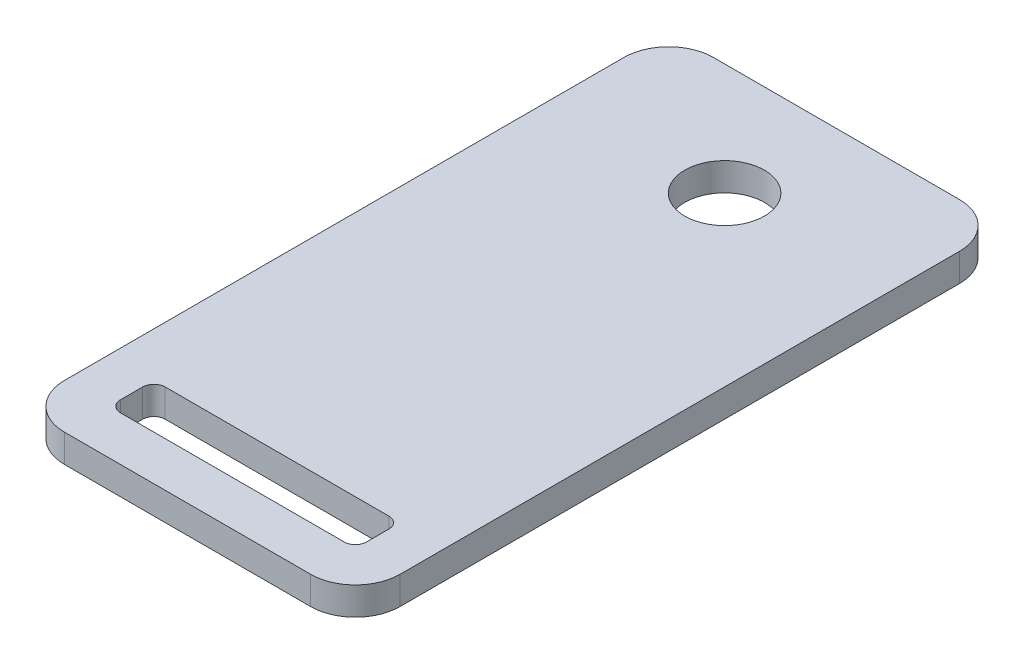
ISO-10303-21;
HEADER;
FILE_DESCRIPTION(('STEP AP214'),'2;1');
FILE_NAME('part.step','',(''),(''),'','','');
FILE_SCHEMA(('AUTOMOTIVE_DESIGN { 1 0 10303 214 1 1 1 1 }'));
ENDSEC;
DATA;
#1=APPLICATION_CONTEXT('core data for automotive mechanical design processes');
#2=APPLICATION_PROTOCOL_DEFINITION('international standard','automotive_design',2000,#1);
#3=PRODUCT_CONTEXT('',#1,'mechanical');
#4=PRODUCT('Part','Part','',(#3));
#5=PRODUCT_RELATED_PRODUCT_CATEGORY('part','',(#4));
#6=PRODUCT_DEFINITION_FORMATION('','',#4);
#7=PRODUCT_DEFINITION_CONTEXT('part definition',#1,'design');
#8=PRODUCT_DEFINITION('design','',#6,#7);
#9=PRODUCT_DEFINITION_SHAPE('','',#8);
#10=(LENGTH_UNIT() NAMED_UNIT(*) SI_UNIT(.MILLI.,.METRE.));
#11=(NAMED_UNIT(*) PLANE_ANGLE_UNIT() SI_UNIT($,.RADIAN.));
#12=(NAMED_UNIT(*) SI_UNIT($,.STERADIAN.) SOLID_ANGLE_UNIT());
#13=UNCERTAINTY_MEASURE_WITH_UNIT(LENGTH_MEASURE(1.E-05),#10,'distance_accuracy_value','');
#14=(GEOMETRIC_REPRESENTATION_CONTEXT(3) GLOBAL_UNCERTAINTY_ASSIGNED_CONTEXT((#13)) GLOBAL_UNIT_ASSIGNED_CONTEXT((#10,
#11,#12)) REPRESENTATION_CONTEXT('',''));
#15=CARTESIAN_POINT('',(0.,0.,0.));
#16=DIRECTION('',(0.,0.,1.));
#17=DIRECTION('',(1.,0.,0.));
#18=AXIS2_PLACEMENT_3D('',#15,#16,#17);
#19=CARTESIAN_POINT('',(0.,3.175,0.));
#20=DIRECTION('',(0.,1.,0.));
#21=DIRECTION('',(0.,0.,1.));
#22=AXIS2_PLACEMENT_3D('',#19,#20,#21);
#23=PLANE('',#22);
#24=DIRECTION('',(-1.,0.,0.));
#25=VECTOR('',#24,1.);
#26=CARTESIAN_POINT('',(-19.05,3.175,-12.7));
#27=LINE('',#26,#25);
#28=CARTESIAN_POINT('',(13.97,3.175,-12.7));
#29=VERTEX_POINT('',#28);
#30=CARTESIAN_POINT('',(-13.97,3.175,-12.7));
#31=VERTEX_POINT('',#30);
#32=EDGE_CURVE('E182',#29,#31,#27,.T.);
#33=ORIENTED_EDGE('',*,*,#32,.T.);
#34=CARTESIAN_POINT('',(-13.97,3.175,-7.62));
#35=DIRECTION('',(0.,1.,0.));
#36=DIRECTION('',(0.,0.,1.));
#37=AXIS2_PLACEMENT_3D('',#34,#35,#36);
#38=CIRCLE('',#37,5.08);
#39=CARTESIAN_POINT('',(-19.05,3.175,-7.62));
#40=VERTEX_POINT('',#39);
#41=EDGE_CURVE('E203',#31,#40,#38,.T.);
#42=ORIENTED_EDGE('',*,*,#41,.T.);
#43=DIRECTION('',(0.,0.,1.));
#44=VECTOR('',#43,1.);
#45=CARTESIAN_POINT('',(-19.05,3.175,-12.7));
#46=LINE('',#45,#44);
#47=CARTESIAN_POINT('',(-19.05,3.175,55.88));
#48=VERTEX_POINT('',#47);
#49=EDGE_CURVE('E165',#40,#48,#46,.T.);
#50=ORIENTED_EDGE('',*,*,#49,.T.);
#51=CARTESIAN_POINT('',(-13.97,3.175,55.88));
#52=DIRECTION('',(0.,1.,0.));
#53=DIRECTION('',(0.,0.,1.));
#54=AXIS2_PLACEMENT_3D('',#51,#52,#53);
#55=CIRCLE('',#54,5.08);
#56=CARTESIAN_POINT('',(-13.97,3.175,60.96));
#57=VERTEX_POINT('',#56);
#58=EDGE_CURVE('E197',#48,#57,#55,.T.);
#59=ORIENTED_EDGE('',*,*,#58,.T.);
#60=DIRECTION('',(1.,0.,0.));
#61=VECTOR('',#60,1.);
#62=CARTESIAN_POINT('',(-19.05,3.175,60.96));
#63=LINE('',#62,#61);
#64=CARTESIAN_POINT('',(13.97,3.175,60.96));
#65=VERTEX_POINT('',#64);
#66=EDGE_CURVE('E279',#57,#65,#63,.T.);
#67=ORIENTED_EDGE('',*,*,#66,.T.);
#68=CARTESIAN_POINT('',(13.97,3.175,55.88));
#69=DIRECTION('',(0.,1.,0.));
#70=DIRECTION('',(0.,0.,1.));
#71=AXIS2_PLACEMENT_3D('',#68,#69,#70);
#72=CIRCLE('',#71,5.08);
#73=CARTESIAN_POINT('',(19.05,3.175,55.88));
#74=VERTEX_POINT('',#73);
#75=EDGE_CURVE('E199',#65,#74,#72,.T.);
#76=ORIENTED_EDGE('',*,*,#75,.T.);
#77=DIRECTION('',(0.,0.,-1.));
#78=VECTOR('',#77,1.);
#79=CARTESIAN_POINT('',(19.05,3.175,-12.7));
#80=LINE('',#79,#78);
#81=CARTESIAN_POINT('',(19.05,3.175,-7.62));
#82=VERTEX_POINT('',#81);
#83=EDGE_CURVE('E281',#74,#82,#80,.T.);
#84=ORIENTED_EDGE('',*,*,#83,.T.);
#85=CARTESIAN_POINT('',(13.97,3.175,-7.62));
#86=DIRECTION('',(0.,1.,0.));
#87=DIRECTION('',(0.,0.,1.));
#88=AXIS2_PLACEMENT_3D('',#85,#86,#87);
#89=CIRCLE('',#88,5.08);
#90=EDGE_CURVE('E201',#82,#29,#89,.T.);
#91=ORIENTED_EDGE('',*,*,#90,.T.);
#92=EDGE_LOOP('',(#33,#42,#50,#59,#67,#76,#84,#91));
#93=FACE_BOUND('',#92,.T.);
#94=CARTESIAN_POINT('',(0.,3.175,0.));
#95=DIRECTION('',(0.,1.,0.));
#96=DIRECTION('',(0.,0.,1.));
#97=AXIS2_PLACEMENT_3D('',#94,#95,#96);
#98=CIRCLE('',#97,4.5212);
#99=CARTESIAN_POINT('',(0.,3.175,4.5212));
#100=VERTEX_POINT('',#99);
#101=EDGE_CURVE('E173',#100,#100,#98,.T.);
#102=ORIENTED_EDGE('',*,*,#101,.F.);
#103=EDGE_LOOP('',(#102));
#104=FACE_BOUND('',#103,.T.);
#105=DIRECTION('',(1.,0.,0.));
#106=VECTOR('',#105,1.);
#107=CARTESIAN_POINT('',(-13.97,3.175,55.8800000000001));
#108=LINE('',#107,#106);
#109=CARTESIAN_POINT('',(-12.7,3.175,55.8800000000001));
#110=VERTEX_POINT('',#109);
#111=CARTESIAN_POINT('',(12.7,3.175,55.88));
#112=VERTEX_POINT('',#111);
#113=EDGE_CURVE('E267',#110,#112,#108,.T.);
#114=ORIENTED_EDGE('',*,*,#113,.F.);
#115=CARTESIAN_POINT('',(-12.7,3.175,54.6100000000001));
#116=DIRECTION('',(0.,1.,0.));
#117=DIRECTION('',(0.,0.,1.));
#118=AXIS2_PLACEMENT_3D('',#115,#116,#117);
#119=CIRCLE('',#118,1.27);
#120=CARTESIAN_POINT('',(-13.97,3.175,54.6100000000001));
#121=VERTEX_POINT('',#120);
#122=EDGE_CURVE('E236',#110,#121,#119,.F.);
#123=ORIENTED_EDGE('',*,*,#122,.T.);
#124=DIRECTION('',(0.,0.,1.));
#125=VECTOR('',#124,1.);
#126=CARTESIAN_POINT('',(-13.97,3.175,50.8));
#127=LINE('',#126,#125);
#128=CARTESIAN_POINT('',(-13.97,3.175,52.07));
#129=VERTEX_POINT('',#128);
#130=EDGE_CURVE('E276',#129,#121,#127,.T.);
#131=ORIENTED_EDGE('',*,*,#130,.F.);
#132=CARTESIAN_POINT('',(-12.7,3.175,52.07));
#133=DIRECTION('',(0.,1.,0.));
#134=DIRECTION('',(0.,0.,1.));
#135=AXIS2_PLACEMENT_3D('',#132,#133,#134);
#136=CIRCLE('',#135,1.27);
#137=CARTESIAN_POINT('',(-12.7,3.175,50.8));
#138=VERTEX_POINT('',#137);
#139=EDGE_CURVE('E11',#129,#138,#136,.F.);
#140=ORIENTED_EDGE('',*,*,#139,.T.);
#141=DIRECTION('',(-1.,0.,0.));
#142=VECTOR('',#141,1.);
#143=CARTESIAN_POINT('',(-13.97,3.175,50.8));
#144=LINE('',#143,#142);
#145=CARTESIAN_POINT('',(12.7,3.175,50.8));
#146=VERTEX_POINT('',#145);
#147=EDGE_CURVE('E260',#146,#138,#144,.T.);
#148=ORIENTED_EDGE('',*,*,#147,.F.);
#149=CARTESIAN_POINT('',(12.7,3.175,52.07));
#150=DIRECTION('',(0.,1.,0.));
#151=DIRECTION('',(0.,0.,1.));
#152=AXIS2_PLACEMENT_3D('',#149,#150,#151);
#153=CIRCLE('',#152,1.27);
#154=CARTESIAN_POINT('',(13.97,3.175,52.07));
#155=VERTEX_POINT('',#154);
#156=EDGE_CURVE('E244',#146,#155,#153,.F.);
#157=ORIENTED_EDGE('',*,*,#156,.T.);
#158=DIRECTION('',(0.,0.,-1.));
#159=VECTOR('',#158,1.);
#160=CARTESIAN_POINT('',(13.97,3.175,50.8));
#161=LINE('',#160,#159);
#162=CARTESIAN_POINT('',(13.97,3.175,54.61));
#163=VERTEX_POINT('',#162);
#164=EDGE_CURVE('E262',#163,#155,#161,.T.);
#165=ORIENTED_EDGE('',*,*,#164,.F.);
#166=CARTESIAN_POINT('',(12.7,3.175,54.61));
#167=DIRECTION('',(0.,1.,0.));
#168=DIRECTION('',(0.,0.,1.));
#169=AXIS2_PLACEMENT_3D('',#166,#167,#168);
#170=CIRCLE('',#169,1.27);
#171=EDGE_CURVE('E240',#163,#112,#170,.F.);
#172=ORIENTED_EDGE('',*,*,#171,.T.);
#173=EDGE_LOOP('',(#114,#123,#131,#140,#148,#157,#165,#172));
#174=FACE_BOUND('',#173,.T.);
#175=ADVANCED_FACE('F32',(#93,#104,#174),#23,.T.);
#176=CARTESIAN_POINT('',(0.,0.,0.));
#177=DIRECTION('',(0.,1.,0.));
#178=DIRECTION('',(0.,0.,1.));
#179=AXIS2_PLACEMENT_3D('',#176,#177,#178);
#180=PLANE('',#179);
#181=CARTESIAN_POINT('',(0.,0.,0.));
#182=DIRECTION('',(0.,1.,0.));
#183=DIRECTION('',(0.,0.,1.));
#184=AXIS2_PLACEMENT_3D('',#181,#182,#183);
#185=CIRCLE('',#184,4.5212);
#186=CARTESIAN_POINT('',(0.,0.,4.5212));
#187=VERTEX_POINT('',#186);
#188=EDGE_CURVE('E179',#187,#187,#185,.T.);
#189=ORIENTED_EDGE('',*,*,#188,.T.);
#190=EDGE_LOOP('',(#189));
#191=FACE_BOUND('',#190,.T.);
#192=DIRECTION('',(0.,0.,1.));
#193=VECTOR('',#192,1.);
#194=CARTESIAN_POINT('',(-19.05,0.,-12.7));
#195=LINE('',#194,#193);
#196=CARTESIAN_POINT('',(-19.05,0.,-7.62));
#197=VERTEX_POINT('',#196);
#198=CARTESIAN_POINT('',(-19.05,0.,55.88));
#199=VERTEX_POINT('',#198);
#200=EDGE_CURVE('E162',#197,#199,#195,.T.);
#201=ORIENTED_EDGE('',*,*,#200,.F.);
#202=CARTESIAN_POINT('',(-13.97,0.,-7.62));
#203=DIRECTION('',(0.,1.,0.));
#204=DIRECTION('',(0.,0.,1.));
#205=AXIS2_PLACEMENT_3D('',#202,#203,#204);
#206=CIRCLE('',#205,5.08);
#207=CARTESIAN_POINT('',(-13.97,0.,-12.7));
#208=VERTEX_POINT('',#207);
#209=EDGE_CURVE('E145',#197,#208,#206,.F.);
#210=ORIENTED_EDGE('',*,*,#209,.T.);
#211=DIRECTION('',(-1.,0.,0.));
#212=VECTOR('',#211,1.);
#213=CARTESIAN_POINT('',(-19.05,0.,-12.7));
#214=LINE('',#213,#212);
#215=CARTESIAN_POINT('',(13.97,0.,-12.7));
#216=VERTEX_POINT('',#215);
#217=EDGE_CURVE('E187',#216,#208,#214,.T.);
#218=ORIENTED_EDGE('',*,*,#217,.F.);
#219=CARTESIAN_POINT('',(13.97,0.,-7.62));
#220=DIRECTION('',(0.,1.,0.));
#221=DIRECTION('',(0.,0.,1.));
#222=AXIS2_PLACEMENT_3D('',#219,#220,#221);
#223=CIRCLE('',#222,5.08);
#224=CARTESIAN_POINT('',(19.05,0.,-7.62));
#225=VERTEX_POINT('',#224);
#226=EDGE_CURVE('E156',#216,#225,#223,.F.);
#227=ORIENTED_EDGE('',*,*,#226,.T.);
#228=DIRECTION('',(0.,0.,-1.));
#229=VECTOR('',#228,1.);
#230=CARTESIAN_POINT('',(19.05,0.,-12.7));
#231=LINE('',#230,#229);
#232=CARTESIAN_POINT('',(19.05,0.,55.88));
#233=VERTEX_POINT('',#232);
#234=EDGE_CURVE('E176',#233,#225,#231,.T.);
#235=ORIENTED_EDGE('',*,*,#234,.F.);
#236=CARTESIAN_POINT('',(13.97,0.,55.88));
#237=DIRECTION('',(0.,1.,0.));
#238=DIRECTION('',(0.,0.,1.));
#239=AXIS2_PLACEMENT_3D('',#236,#237,#238);
#240=CIRCLE('',#239,5.08);
#241=CARTESIAN_POINT('',(13.97,0.,60.96));
#242=VERTEX_POINT('',#241);
#243=EDGE_CURVE('E191',#233,#242,#240,.F.);
#244=ORIENTED_EDGE('',*,*,#243,.T.);
#245=DIRECTION('',(1.,0.,0.));
#246=VECTOR('',#245,1.);
#247=CARTESIAN_POINT('',(-19.05,0.,60.96));
#248=LINE('',#247,#246);
#249=CARTESIAN_POINT('',(-13.97,0.,60.96));
#250=VERTEX_POINT('',#249);
#251=EDGE_CURVE('E172',#250,#242,#248,.T.);
#252=ORIENTED_EDGE('',*,*,#251,.F.);
#253=CARTESIAN_POINT('',(-13.97,0.,55.88));
#254=DIRECTION('',(0.,1.,0.));
#255=DIRECTION('',(0.,0.,1.));
#256=AXIS2_PLACEMENT_3D('',#253,#254,#255);
#257=CIRCLE('',#256,5.08);
#258=EDGE_CURVE('E166',#250,#199,#257,.F.);
#259=ORIENTED_EDGE('',*,*,#258,.T.);
#260=EDGE_LOOP('',(#201,#210,#218,#227,#235,#244,#252,#259));
#261=FACE_BOUND('',#260,.T.);
#262=DIRECTION('',(-1.,0.,0.));
#263=VECTOR('',#262,1.);
#264=CARTESIAN_POINT('',(-13.97,0.,50.8));
#265=LINE('',#264,#263);
#266=CARTESIAN_POINT('',(12.7,0.,50.8));
#267=VERTEX_POINT('',#266);
#268=CARTESIAN_POINT('',(-12.7,0.,50.8));
#269=VERTEX_POINT('',#268);
#270=EDGE_CURVE('E249',#267,#269,#265,.T.);
#271=ORIENTED_EDGE('',*,*,#270,.T.);
#272=CARTESIAN_POINT('',(-12.7,0.,52.07));
#273=DIRECTION('',(0.,1.,0.));
#274=DIRECTION('',(0.,0.,1.));
#275=AXIS2_PLACEMENT_3D('',#272,#273,#274);
#276=CIRCLE('',#275,1.27);
#277=CARTESIAN_POINT('',(-13.97,0.,52.07));
#278=VERTEX_POINT('',#277);
#279=EDGE_CURVE('E40',#269,#278,#276,.T.);
#280=ORIENTED_EDGE('',*,*,#279,.T.);
#281=DIRECTION('',(0.,0.,1.));
#282=VECTOR('',#281,1.);
#283=CARTESIAN_POINT('',(-13.97,0.,50.8));
#284=LINE('',#283,#282);
#285=CARTESIAN_POINT('',(-13.97,0.,54.6100000000001));
#286=VERTEX_POINT('',#285);
#287=EDGE_CURVE('E248',#278,#286,#284,.T.);
#288=ORIENTED_EDGE('',*,*,#287,.T.);
#289=CARTESIAN_POINT('',(-12.7,0.,54.6100000000001));
#290=DIRECTION('',(0.,1.,0.));
#291=DIRECTION('',(0.,0.,1.));
#292=AXIS2_PLACEMENT_3D('',#289,#290,#291);
#293=CIRCLE('',#292,1.27);
#294=CARTESIAN_POINT('',(-12.7,0.,55.8800000000001));
#295=VERTEX_POINT('',#294);
#296=EDGE_CURVE('E234',#286,#295,#293,.T.);
#297=ORIENTED_EDGE('',*,*,#296,.T.);
#298=DIRECTION('',(1.,0.,0.));
#299=VECTOR('',#298,1.);
#300=CARTESIAN_POINT('',(-13.97,0.,55.8800000000001));
#301=LINE('',#300,#299);
#302=CARTESIAN_POINT('',(12.7,0.,55.88));
#303=VERTEX_POINT('',#302);
#304=EDGE_CURVE('E257',#295,#303,#301,.T.);
#305=ORIENTED_EDGE('',*,*,#304,.T.);
#306=CARTESIAN_POINT('',(12.7,0.,54.61));
#307=DIRECTION('',(0.,1.,0.));
#308=DIRECTION('',(0.,0.,1.));
#309=AXIS2_PLACEMENT_3D('',#306,#307,#308);
#310=CIRCLE('',#309,1.27);
#311=CARTESIAN_POINT('',(13.97,0.,54.61));
#312=VERTEX_POINT('',#311);
#313=EDGE_CURVE('E238',#303,#312,#310,.T.);
#314=ORIENTED_EDGE('',*,*,#313,.T.);
#315=DIRECTION('',(0.,0.,-1.));
#316=VECTOR('',#315,1.);
#317=CARTESIAN_POINT('',(13.97,0.,50.8));
#318=LINE('',#317,#316);
#319=CARTESIAN_POINT('',(13.97,0.,52.07));
#320=VERTEX_POINT('',#319);
#321=EDGE_CURVE('E273',#312,#320,#318,.T.);
#322=ORIENTED_EDGE('',*,*,#321,.T.);
#323=CARTESIAN_POINT('',(12.7,0.,52.07));
#324=DIRECTION('',(0.,1.,0.));
#325=DIRECTION('',(0.,0.,1.));
#326=AXIS2_PLACEMENT_3D('',#323,#324,#325);
#327=CIRCLE('',#326,1.27);
#328=EDGE_CURVE('E242',#320,#267,#327,.T.);
#329=ORIENTED_EDGE('',*,*,#328,.T.);
#330=EDGE_LOOP('',(#271,#280,#288,#297,#305,#314,#322,#329));
#331=FACE_BOUND('',#330,.T.);
#332=ADVANCED_FACE('F169',(#191,#261,#331),#180,.F.);
#333=CARTESIAN_POINT('',(-19.05,3.175,-12.7));
#334=DIRECTION('',(1.,0.,0.));
#335=DIRECTION('',(0.,0.,-1.));
#336=AXIS2_PLACEMENT_3D('',#333,#334,#335);
#337=PLANE('',#336);
#338=ORIENTED_EDGE('',*,*,#49,.F.);
#339=DIRECTION('',(0.,-1.,0.));
#340=VECTOR('',#339,1.);
#341=CARTESIAN_POINT('',(-19.05,3.175,-7.62));
#342=LINE('',#341,#340);
#343=EDGE_CURVE('E149',#40,#197,#342,.T.);
#344=ORIENTED_EDGE('',*,*,#343,.T.);
#345=ORIENTED_EDGE('',*,*,#200,.T.);
#346=DIRECTION('',(0.,-1.,0.));
#347=VECTOR('',#346,1.);
#348=CARTESIAN_POINT('',(-19.05,3.175,55.88));
#349=LINE('',#348,#347);
#350=EDGE_CURVE('E167',#199,#48,#349,.F.);
#351=ORIENTED_EDGE('',*,*,#350,.T.);
#352=EDGE_LOOP('',(#338,#344,#345,#351));
#353=FACE_BOUND('',#352,.T.);
#354=ADVANCED_FACE('F161',(#353),#337,.F.);
#355=CARTESIAN_POINT('',(-19.05,3.175,60.96));
#356=DIRECTION('',(0.,0.,-1.));
#357=DIRECTION('',(-1.,0.,0.));
#358=AXIS2_PLACEMENT_3D('',#355,#356,#357);
#359=PLANE('',#358);
#360=ORIENTED_EDGE('',*,*,#251,.T.);
#361=DIRECTION('',(0.,-1.,0.));
#362=VECTOR('',#361,1.);
#363=CARTESIAN_POINT('',(13.97,3.175,60.96));
#364=LINE('',#363,#362);
#365=EDGE_CURVE('E213',#242,#65,#364,.F.);
#366=ORIENTED_EDGE('',*,*,#365,.T.);
#367=ORIENTED_EDGE('',*,*,#66,.F.);
#368=DIRECTION('',(0.,-1.,0.));
#369=VECTOR('',#368,1.);
#370=CARTESIAN_POINT('',(-13.97,3.175,60.96));
#371=LINE('',#370,#369);
#372=EDGE_CURVE('E210',#57,#250,#371,.T.);
#373=ORIENTED_EDGE('',*,*,#372,.T.);
#374=EDGE_LOOP('',(#360,#366,#367,#373));
#375=FACE_BOUND('',#374,.T.);
#376=ADVANCED_FACE('F304',(#375),#359,.F.);
#377=CARTESIAN_POINT('',(19.05,3.175,-12.7));
#378=DIRECTION('',(-1.,0.,0.));
#379=DIRECTION('',(0.,0.,1.));
#380=AXIS2_PLACEMENT_3D('',#377,#378,#379);
#381=PLANE('',#380);
#382=ORIENTED_EDGE('',*,*,#234,.T.);
#383=DIRECTION('',(0.,-1.,0.));
#384=VECTOR('',#383,1.);
#385=CARTESIAN_POINT('',(19.05,3.175,-7.62));
#386=LINE('',#385,#384);
#387=EDGE_CURVE('E208',#225,#82,#386,.F.);
#388=ORIENTED_EDGE('',*,*,#387,.T.);
#389=ORIENTED_EDGE('',*,*,#83,.F.);
#390=DIRECTION('',(0.,-1.,0.));
#391=VECTOR('',#390,1.);
#392=CARTESIAN_POINT('',(19.05,3.175,55.88));
#393=LINE('',#392,#391);
#394=EDGE_CURVE('E205',#74,#233,#393,.T.);
#395=ORIENTED_EDGE('',*,*,#394,.T.);
#396=EDGE_LOOP('',(#382,#388,#389,#395));
#397=FACE_BOUND('',#396,.T.);
#398=ADVANCED_FACE('F297',(#397),#381,.F.);
#399=CARTESIAN_POINT('',(-19.05,3.175,-12.7));
#400=DIRECTION('',(0.,0.,1.));
#401=DIRECTION('',(1.,0.,0.));
#402=AXIS2_PLACEMENT_3D('',#399,#400,#401);
#403=PLANE('',#402);
#404=ORIENTED_EDGE('',*,*,#217,.T.);
#405=DIRECTION('',(0.,-1.,0.));
#406=VECTOR('',#405,1.);
#407=CARTESIAN_POINT('',(-13.97,3.175,-12.7));
#408=LINE('',#407,#406);
#409=EDGE_CURVE('E150',#208,#31,#408,.F.);
#410=ORIENTED_EDGE('',*,*,#409,.T.);
#411=ORIENTED_EDGE('',*,*,#32,.F.);
#412=DIRECTION('',(0.,-1.,0.));
#413=VECTOR('',#412,1.);
#414=CARTESIAN_POINT('',(13.97,3.175,-12.7));
#415=LINE('',#414,#413);
#416=EDGE_CURVE('E155',#29,#216,#415,.T.);
#417=ORIENTED_EDGE('',*,*,#416,.T.);
#418=EDGE_LOOP('',(#404,#410,#411,#417));
#419=FACE_BOUND('',#418,.T.);
#420=ADVANCED_FACE('F291',(#419),#403,.F.);
#421=CARTESIAN_POINT('',(0.,3.175,0.));
#422=DIRECTION('',(0.,-1.,0.));
#423=DIRECTION('',(0.,0.,-1.));
#424=AXIS2_PLACEMENT_3D('',#421,#422,#423);
#425=CYLINDRICAL_SURFACE('',#424,4.5212);
#426=ORIENTED_EDGE('',*,*,#101,.T.);
#427=EDGE_LOOP('',(#426));
#428=FACE_BOUND('',#427,.T.);
#429=ORIENTED_EDGE('',*,*,#188,.F.);
#430=EDGE_LOOP('',(#429));
#431=FACE_BOUND('',#430,.T.);
#432=ADVANCED_FACE('F329',(#428,#431),#425,.F.);
#433=CARTESIAN_POINT('',(-13.97,3.175,50.8));
#434=DIRECTION('',(1.,0.,0.));
#435=DIRECTION('',(0.,0.,-1.));
#436=AXIS2_PLACEMENT_3D('',#433,#434,#435);
#437=PLANE('',#436);
#438=ORIENTED_EDGE('',*,*,#130,.T.);
#439=DIRECTION('',(0.,-1.,0.));
#440=VECTOR('',#439,1.);
#441=CARTESIAN_POINT('',(-13.97,0.,54.6100000000001));
#442=LINE('',#441,#440);
#443=EDGE_CURVE('E217',#121,#286,#442,.T.);
#444=ORIENTED_EDGE('',*,*,#443,.T.);
#445=ORIENTED_EDGE('',*,*,#287,.F.);
#446=DIRECTION('',(0.,-1.,0.));
#447=VECTOR('',#446,1.);
#448=CARTESIAN_POINT('',(-13.97,3.175,52.07));
#449=LINE('',#448,#447);
#450=EDGE_CURVE('E215',#278,#129,#449,.F.);
#451=ORIENTED_EDGE('',*,*,#450,.T.);
#452=EDGE_LOOP('',(#438,#444,#445,#451));
#453=FACE_BOUND('',#452,.T.);
#454=ADVANCED_FACE('F255',(#453),#437,.T.);
#455=CARTESIAN_POINT('',(-13.97,3.175,55.8800000000001));
#456=DIRECTION('',(0.,0.,-1.));
#457=DIRECTION('',(-1.,0.,0.));
#458=AXIS2_PLACEMENT_3D('',#455,#456,#457);
#459=PLANE('',#458);
#460=ORIENTED_EDGE('',*,*,#304,.F.);
#461=DIRECTION('',(0.,-1.,0.));
#462=VECTOR('',#461,1.);
#463=CARTESIAN_POINT('',(-12.7,3.175,55.8800000000001));
#464=LINE('',#463,#462);
#465=EDGE_CURVE('E223',#295,#110,#464,.F.);
#466=ORIENTED_EDGE('',*,*,#465,.T.);
#467=ORIENTED_EDGE('',*,*,#113,.T.);
#468=DIRECTION('',(0.,-1.,0.));
#469=VECTOR('',#468,1.);
#470=CARTESIAN_POINT('',(12.7,0.,55.88));
#471=LINE('',#470,#469);
#472=EDGE_CURVE('E220',#112,#303,#471,.T.);
#473=ORIENTED_EDGE('',*,*,#472,.T.);
#474=EDGE_LOOP('',(#460,#466,#467,#473));
#475=FACE_BOUND('',#474,.T.);
#476=ADVANCED_FACE('F377',(#475),#459,.T.);
#477=CARTESIAN_POINT('',(13.97,3.175,50.8));
#478=DIRECTION('',(-1.,0.,0.));
#479=DIRECTION('',(0.,0.,1.));
#480=AXIS2_PLACEMENT_3D('',#477,#478,#479);
#481=PLANE('',#480);
#482=ORIENTED_EDGE('',*,*,#321,.F.);
#483=DIRECTION('',(0.,-1.,0.));
#484=VECTOR('',#483,1.);
#485=CARTESIAN_POINT('',(13.97,3.175,54.61));
#486=LINE('',#485,#484);
#487=EDGE_CURVE('E228',#312,#163,#486,.F.);
#488=ORIENTED_EDGE('',*,*,#487,.T.);
#489=ORIENTED_EDGE('',*,*,#164,.T.);
#490=DIRECTION('',(0.,-1.,0.));
#491=VECTOR('',#490,1.);
#492=CARTESIAN_POINT('',(13.97,0.,52.07));
#493=LINE('',#492,#491);
#494=EDGE_CURVE('E225',#155,#320,#493,.T.);
#495=ORIENTED_EDGE('',*,*,#494,.T.);
#496=EDGE_LOOP('',(#482,#488,#489,#495));
#497=FACE_BOUND('',#496,.T.);
#498=ADVANCED_FACE('F387',(#497),#481,.T.);
#499=CARTESIAN_POINT('',(-13.97,3.175,50.8));
#500=DIRECTION('',(0.,0.,1.));
#501=DIRECTION('',(1.,0.,0.));
#502=AXIS2_PLACEMENT_3D('',#499,#500,#501);
#503=PLANE('',#502);
#504=ORIENTED_EDGE('',*,*,#270,.F.);
#505=DIRECTION('',(0.,-1.,0.));
#506=VECTOR('',#505,1.);
#507=CARTESIAN_POINT('',(12.7,3.175,50.8));
#508=LINE('',#507,#506);
#509=EDGE_CURVE('E52',#267,#146,#508,.F.);
#510=ORIENTED_EDGE('',*,*,#509,.T.);
#511=ORIENTED_EDGE('',*,*,#147,.T.);
#512=DIRECTION('',(0.,-1.,0.));
#513=VECTOR('',#512,1.);
#514=CARTESIAN_POINT('',(-12.7,0.,50.8));
#515=LINE('',#514,#513);
#516=EDGE_CURVE('E230',#138,#269,#515,.T.);
#517=ORIENTED_EDGE('',*,*,#516,.T.);
#518=EDGE_LOOP('',(#504,#510,#511,#517));
#519=FACE_BOUND('',#518,.T.);
#520=ADVANCED_FACE('F259',(#519),#503,.T.);
#521=CARTESIAN_POINT('',(-13.97,3.175,-7.62));
#522=DIRECTION('',(0.,-1.,0.));
#523=DIRECTION('',(0.,0.,-1.));
#524=AXIS2_PLACEMENT_3D('',#521,#522,#523);
#525=CYLINDRICAL_SURFACE('',#524,5.08);
#526=ORIENTED_EDGE('',*,*,#41,.F.);
#527=ORIENTED_EDGE('',*,*,#409,.F.);
#528=ORIENTED_EDGE('',*,*,#209,.F.);
#529=ORIENTED_EDGE('',*,*,#343,.F.);
#530=EDGE_LOOP('',(#526,#527,#528,#529));
#531=FACE_BOUND('',#530,.T.);
#532=ADVANCED_FACE('F148',(#531),#525,.T.);
#533=CARTESIAN_POINT('',(13.97,3.175,-7.62));
#534=DIRECTION('',(0.,-1.,0.));
#535=DIRECTION('',(0.,0.,-1.));
#536=AXIS2_PLACEMENT_3D('',#533,#534,#535);
#537=CYLINDRICAL_SURFACE('',#536,5.08);
#538=ORIENTED_EDGE('',*,*,#90,.F.);
#539=ORIENTED_EDGE('',*,*,#387,.F.);
#540=ORIENTED_EDGE('',*,*,#226,.F.);
#541=ORIENTED_EDGE('',*,*,#416,.F.);
#542=EDGE_LOOP('',(#538,#539,#540,#541));
#543=FACE_BOUND('',#542,.T.);
#544=ADVANCED_FACE('F293',(#543),#537,.T.);
#545=CARTESIAN_POINT('',(13.97,3.175,55.88));
#546=DIRECTION('',(0.,-1.,0.));
#547=DIRECTION('',(0.,0.,-1.));
#548=AXIS2_PLACEMENT_3D('',#545,#546,#547);
#549=CYLINDRICAL_SURFACE('',#548,5.08);
#550=ORIENTED_EDGE('',*,*,#75,.F.);
#551=ORIENTED_EDGE('',*,*,#365,.F.);
#552=ORIENTED_EDGE('',*,*,#243,.F.);
#553=ORIENTED_EDGE('',*,*,#394,.F.);
#554=EDGE_LOOP('',(#550,#551,#552,#553));
#555=FACE_BOUND('',#554,.T.);
#556=ADVANCED_FACE('F301',(#555),#549,.T.);
#557=CARTESIAN_POINT('',(-13.97,3.175,55.88));
#558=DIRECTION('',(0.,-1.,0.));
#559=DIRECTION('',(0.,0.,-1.));
#560=AXIS2_PLACEMENT_3D('',#557,#558,#559);
#561=CYLINDRICAL_SURFACE('',#560,5.08);
#562=ORIENTED_EDGE('',*,*,#58,.F.);
#563=ORIENTED_EDGE('',*,*,#350,.F.);
#564=ORIENTED_EDGE('',*,*,#258,.F.);
#565=ORIENTED_EDGE('',*,*,#372,.F.);
#566=EDGE_LOOP('',(#562,#563,#564,#565));
#567=FACE_BOUND('',#566,.T.);
#568=ADVANCED_FACE('F309',(#567),#561,.T.);
#569=CARTESIAN_POINT('',(-12.7,3.175,54.6100000000001));
#570=DIRECTION('',(0.,1.,0.));
#571=DIRECTION('',(0.,0.,1.));
#572=AXIS2_PLACEMENT_3D('',#569,#570,#571);
#573=CYLINDRICAL_SURFACE('',#572,1.27);
#574=ORIENTED_EDGE('',*,*,#122,.F.);
#575=ORIENTED_EDGE('',*,*,#465,.F.);
#576=ORIENTED_EDGE('',*,*,#296,.F.);
#577=ORIENTED_EDGE('',*,*,#443,.F.);
#578=EDGE_LOOP('',(#574,#575,#576,#577));
#579=FACE_BOUND('',#578,.T.);
#580=ADVANCED_FACE('F311',(#579),#573,.F.);
#581=CARTESIAN_POINT('',(12.7,3.175,54.61));
#582=DIRECTION('',(0.,1.,0.));
#583=DIRECTION('',(0.,0.,1.));
#584=AXIS2_PLACEMENT_3D('',#581,#582,#583);
#585=CYLINDRICAL_SURFACE('',#584,1.27);
#586=ORIENTED_EDGE('',*,*,#171,.F.);
#587=ORIENTED_EDGE('',*,*,#487,.F.);
#588=ORIENTED_EDGE('',*,*,#313,.F.);
#589=ORIENTED_EDGE('',*,*,#472,.F.);
#590=EDGE_LOOP('',(#586,#587,#588,#589));
#591=FACE_BOUND('',#590,.T.);
#592=ADVANCED_FACE('F317',(#591),#585,.F.);
#593=CARTESIAN_POINT('',(12.7,3.175,52.07));
#594=DIRECTION('',(0.,1.,0.));
#595=DIRECTION('',(0.,0.,1.));
#596=AXIS2_PLACEMENT_3D('',#593,#594,#595);
#597=CYLINDRICAL_SURFACE('',#596,1.27);
#598=ORIENTED_EDGE('',*,*,#156,.F.);
#599=ORIENTED_EDGE('',*,*,#509,.F.);
#600=ORIENTED_EDGE('',*,*,#328,.F.);
#601=ORIENTED_EDGE('',*,*,#494,.F.);
#602=EDGE_LOOP('',(#598,#599,#600,#601));
#603=FACE_BOUND('',#602,.T.);
#604=ADVANCED_FACE('F419',(#603),#597,.F.);
#605=CARTESIAN_POINT('',(-12.7,3.175,52.07));
#606=DIRECTION('',(0.,1.,0.));
#607=DIRECTION('',(0.,0.,1.));
#608=AXIS2_PLACEMENT_3D('',#605,#606,#607);
#609=CYLINDRICAL_SURFACE('',#608,1.27);
#610=ORIENTED_EDGE('',*,*,#139,.F.);
#611=ORIENTED_EDGE('',*,*,#450,.F.);
#612=ORIENTED_EDGE('',*,*,#279,.F.);
#613=ORIENTED_EDGE('',*,*,#516,.F.);
#614=EDGE_LOOP('',(#610,#611,#612,#613));
#615=FACE_BOUND('',#614,.T.);
#616=ADVANCED_FACE('F34',(#615),#609,.F.);
#617=CLOSED_SHELL('',(#175,#332,#354,#376,#398,#420,#432,#454,#476,#498,#520,#532,#544,#556,
#568,#580,#592,#604,#616));
#618=MANIFOLD_SOLID_BREP('B2',#617);
#619=ADVANCED_BREP_SHAPE_REPRESENTATION('',(#18,#618),#14);
#620=SHAPE_DEFINITION_REPRESENTATION(#9,#619);
ENDSEC;
END-ISO-10303-21;
